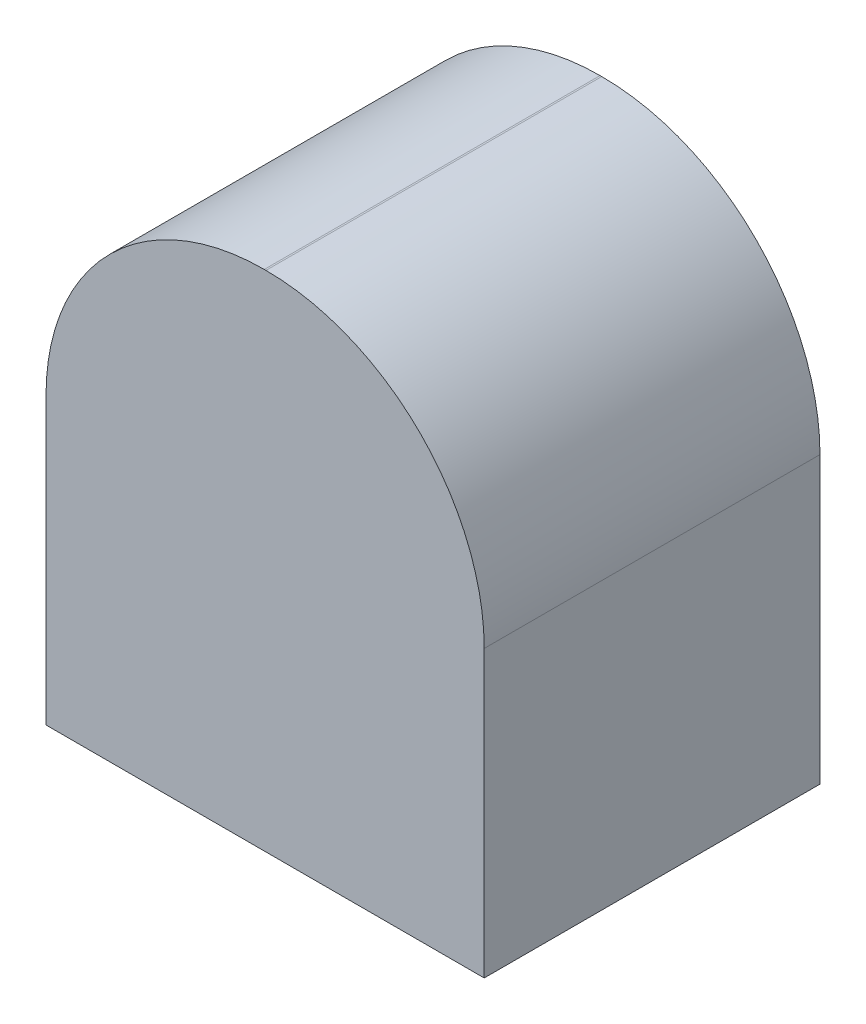
ISO-10303-21;
HEADER;
FILE_DESCRIPTION(('STEP AP214'),'2;1');
FILE_NAME('part.step','',(''),(''),'','','');
FILE_SCHEMA(('AUTOMOTIVE_DESIGN { 1 0 10303 214 1 1 1 1 }'));
ENDSEC;
DATA;
#1=APPLICATION_CONTEXT('core data for automotive mechanical design processes');
#2=APPLICATION_PROTOCOL_DEFINITION('international standard','automotive_design',2000,#1);
#3=PRODUCT_CONTEXT('',#1,'mechanical');
#4=PRODUCT('Part','Part','',(#3));
#5=PRODUCT_RELATED_PRODUCT_CATEGORY('part','',(#4));
#6=PRODUCT_DEFINITION_FORMATION('','',#4);
#7=PRODUCT_DEFINITION_CONTEXT('part definition',#1,'design');
#8=PRODUCT_DEFINITION('design','',#6,#7);
#9=PRODUCT_DEFINITION_SHAPE('','',#8);
#10=(LENGTH_UNIT() NAMED_UNIT(*) SI_UNIT(.MILLI.,.METRE.));
#11=(NAMED_UNIT(*) PLANE_ANGLE_UNIT() SI_UNIT($,.RADIAN.));
#12=(NAMED_UNIT(*) SI_UNIT($,.STERADIAN.) SOLID_ANGLE_UNIT());
#13=UNCERTAINTY_MEASURE_WITH_UNIT(LENGTH_MEASURE(1.E-05),#10,'distance_accuracy_value','');
#14=(GEOMETRIC_REPRESENTATION_CONTEXT(3) GLOBAL_UNCERTAINTY_ASSIGNED_CONTEXT((#13)) GLOBAL_UNIT_ASSIGNED_CONTEXT((#10,
#11,#12)) REPRESENTATION_CONTEXT('',''));
#15=CARTESIAN_POINT('',(0.,0.,0.));
#16=DIRECTION('',(0.,0.,1.));
#17=DIRECTION('',(1.,0.,0.));
#18=AXIS2_PLACEMENT_3D('',#15,#16,#17);
#19=CARTESIAN_POINT('',(0.86950042,0.,0.1999996));
#20=DIRECTION('',(0.,0.,-1.));
#21=DIRECTION('',(-1.,0.,0.));
#22=AXIS2_PLACEMENT_3D('',#19,#20,#21);
#23=PLANE('',#22);
#24=DIRECTION('',(1.,0.,0.));
#25=VECTOR('',#24,1.);
#26=CARTESIAN_POINT('',(1.13050066,0.2999994,0.1999996));
#27=LINE('',#26,#25);
#28=CARTESIAN_POINT('',(0.99950042,0.2999994,0.1999996));
#29=VERTEX_POINT('',#28);
#30=CARTESIAN_POINT('',(1.00050066,0.2999994,0.1999996));
#31=VERTEX_POINT('',#30);
#32=EDGE_CURVE('E11',#29,#31,#27,.T.);
#33=ORIENTED_EDGE('',*,*,#32,.F.);
#34=CARTESIAN_POINT('',(0.99950042,0.1699994,0.1999996));
#35=DIRECTION('',(0.,0.,-1.));
#36=DIRECTION('',(1.,0.,0.));
#37=AXIS2_PLACEMENT_3D('',#34,#35,#36);
#38=CIRCLE('',#37,0.13);
#39=CARTESIAN_POINT('',(0.86950042,0.1699994,0.1999996));
#40=VERTEX_POINT('',#39);
#41=EDGE_CURVE('E24',#40,#29,#38,.T.);
#42=ORIENTED_EDGE('',*,*,#41,.F.);
#43=DIRECTION('',(0.,1.,0.));
#44=VECTOR('',#43,1.);
#45=CARTESIAN_POINT('',(0.86950042,0.,0.1999996));
#46=LINE('',#45,#44);
#47=CARTESIAN_POINT('',(0.86950042,0.,0.1999996));
#48=VERTEX_POINT('',#47);
#49=EDGE_CURVE('E117',#48,#40,#46,.T.);
#50=ORIENTED_EDGE('',*,*,#49,.F.);
#51=DIRECTION('',(-1.,0.,0.));
#52=VECTOR('',#51,1.);
#53=CARTESIAN_POINT('',(0.86950042,0.,0.1999996));
#54=LINE('',#53,#52);
#55=CARTESIAN_POINT('',(1.13050066,0.,0.1999996));
#56=VERTEX_POINT('',#55);
#57=EDGE_CURVE('E115',#56,#48,#54,.T.);
#58=ORIENTED_EDGE('',*,*,#57,.F.);
#59=DIRECTION('',(0.,-1.,0.));
#60=VECTOR('',#59,1.);
#61=CARTESIAN_POINT('',(1.13050066,0.,0.1999996));
#62=LINE('',#61,#60);
#63=CARTESIAN_POINT('',(1.13050066,0.1699994,0.1999996));
#64=VERTEX_POINT('',#63);
#65=EDGE_CURVE('E73',#64,#56,#62,.T.);
#66=ORIENTED_EDGE('',*,*,#65,.F.);
#67=CARTESIAN_POINT('',(1.00050066,0.1699994,0.1999996));
#68=DIRECTION('',(0.,0.,-1.));
#69=DIRECTION('',(1.,0.,0.));
#70=AXIS2_PLACEMENT_3D('',#67,#68,#69);
#71=CIRCLE('',#70,0.13);
#72=EDGE_CURVE('E111',#31,#64,#71,.T.);
#73=ORIENTED_EDGE('',*,*,#72,.F.);
#74=EDGE_LOOP('',(#33,#42,#50,#58,#66,#73));
#75=FACE_BOUND('',#74,.T.);
#76=ADVANCED_FACE('F17',(#75),#23,.F.);
#77=CARTESIAN_POINT('',(1.00050066,0.1699994,0.));
#78=DIRECTION('',(0.,0.,1.));
#79=DIRECTION('',(1.,0.,0.));
#80=AXIS2_PLACEMENT_3D('',#77,#78,#79);
#81=CYLINDRICAL_SURFACE('',#80,0.13);
#82=ORIENTED_EDGE('',*,*,#72,.T.);
#83=DIRECTION('',(0.,0.,-1.));
#84=VECTOR('',#83,1.);
#85=CARTESIAN_POINT('',(1.13050066,0.1699994,0.));
#86=LINE('',#85,#84);
#87=CARTESIAN_POINT('',(1.13050066,0.1699994,0.));
#88=VERTEX_POINT('',#87);
#89=EDGE_CURVE('E109',#64,#88,#86,.T.);
#90=ORIENTED_EDGE('',*,*,#89,.T.);
#91=CARTESIAN_POINT('',(1.00050066,0.1699994,0.));
#92=DIRECTION('',(0.,0.,1.));
#93=DIRECTION('',(1.,0.,0.));
#94=AXIS2_PLACEMENT_3D('',#91,#92,#93);
#95=CIRCLE('',#94,0.13);
#96=CARTESIAN_POINT('',(1.00050066,0.2999994,0.));
#97=VERTEX_POINT('',#96);
#98=EDGE_CURVE('E89',#88,#97,#95,.T.);
#99=ORIENTED_EDGE('',*,*,#98,.T.);
#100=DIRECTION('',(0.,0.,1.));
#101=VECTOR('',#100,1.);
#102=CARTESIAN_POINT('',(1.00050066,0.2999994,0.));
#103=LINE('',#102,#101);
#104=EDGE_CURVE('E105',#97,#31,#103,.T.);
#105=ORIENTED_EDGE('',*,*,#104,.T.);
#106=EDGE_LOOP('',(#82,#90,#99,#105));
#107=FACE_BOUND('',#106,.T.);
#108=ADVANCED_FACE('F127',(#107),#81,.T.);
#109=CARTESIAN_POINT('',(1.13050066,0.2999994,0.));
#110=DIRECTION('',(0.,-1.,0.));
#111=DIRECTION('',(0.,0.,-1.));
#112=AXIS2_PLACEMENT_3D('',#109,#110,#111);
#113=PLANE('',#112);
#114=DIRECTION('',(1.,0.,0.));
#115=VECTOR('',#114,1.);
#116=CARTESIAN_POINT('',(0.86950042,0.2999994,0.));
#117=LINE('',#116,#115);
#118=CARTESIAN_POINT('',(0.99950042,0.2999994,0.));
#119=VERTEX_POINT('',#118);
#120=EDGE_CURVE('E103',#119,#97,#117,.T.);
#121=ORIENTED_EDGE('',*,*,#120,.F.);
#122=DIRECTION('',(0.,0.,-1.));
#123=VECTOR('',#122,1.);
#124=CARTESIAN_POINT('',(0.99950042,0.2999994,0.));
#125=LINE('',#124,#123);
#126=EDGE_CURVE('E100',#29,#119,#125,.T.);
#127=ORIENTED_EDGE('',*,*,#126,.F.);
#128=ORIENTED_EDGE('',*,*,#32,.T.);
#129=ORIENTED_EDGE('',*,*,#104,.F.);
#130=EDGE_LOOP('',(#121,#127,#128,#129));
#131=FACE_BOUND('',#130,.T.);
#132=ADVANCED_FACE('F123',(#131),#113,.F.);
#133=CARTESIAN_POINT('',(0.99950042,0.1699994,0.));
#134=DIRECTION('',(0.,0.,1.));
#135=DIRECTION('',(1.,0.,0.));
#136=AXIS2_PLACEMENT_3D('',#133,#134,#135);
#137=CYLINDRICAL_SURFACE('',#136,0.13);
#138=ORIENTED_EDGE('',*,*,#41,.T.);
#139=ORIENTED_EDGE('',*,*,#126,.T.);
#140=CARTESIAN_POINT('',(0.99950042,0.1699994,0.));
#141=DIRECTION('',(0.,0.,1.));
#142=DIRECTION('',(1.,0.,0.));
#143=AXIS2_PLACEMENT_3D('',#140,#141,#142);
#144=CIRCLE('',#143,0.13);
#145=CARTESIAN_POINT('',(0.86950042,0.1699994,0.));
#146=VERTEX_POINT('',#145);
#147=EDGE_CURVE('E98',#119,#146,#144,.T.);
#148=ORIENTED_EDGE('',*,*,#147,.T.);
#149=DIRECTION('',(0.,0.,1.));
#150=VECTOR('',#149,1.);
#151=CARTESIAN_POINT('',(0.86950042,0.1699994,0.));
#152=LINE('',#151,#150);
#153=EDGE_CURVE('E95',#146,#40,#152,.T.);
#154=ORIENTED_EDGE('',*,*,#153,.T.);
#155=EDGE_LOOP('',(#138,#139,#148,#154));
#156=FACE_BOUND('',#155,.T.);
#157=ADVANCED_FACE('F120',(#156),#137,.T.);
#158=CARTESIAN_POINT('',(0.86950042,0.2999994,0.));
#159=DIRECTION('',(1.,0.,0.));
#160=DIRECTION('',(0.,0.,-1.));
#161=AXIS2_PLACEMENT_3D('',#158,#159,#160);
#162=PLANE('',#161);
#163=DIRECTION('',(0.,1.,0.));
#164=VECTOR('',#163,1.);
#165=CARTESIAN_POINT('',(0.86950042,0.2999994,0.));
#166=LINE('',#165,#164);
#167=CARTESIAN_POINT('',(0.86950042,0.,0.));
#168=VERTEX_POINT('',#167);
#169=EDGE_CURVE('E93',#168,#146,#166,.T.);
#170=ORIENTED_EDGE('',*,*,#169,.F.);
#171=DIRECTION('',(0.,0.,-1.));
#172=VECTOR('',#171,1.);
#173=CARTESIAN_POINT('',(0.86950042,0.,0.));
#174=LINE('',#173,#172);
#175=EDGE_CURVE('E76',#48,#168,#174,.T.);
#176=ORIENTED_EDGE('',*,*,#175,.F.);
#177=ORIENTED_EDGE('',*,*,#49,.T.);
#178=ORIENTED_EDGE('',*,*,#153,.F.);
#179=EDGE_LOOP('',(#170,#176,#177,#178));
#180=FACE_BOUND('',#179,.T.);
#181=ADVANCED_FACE('F125',(#180),#162,.F.);
#182=CARTESIAN_POINT('',(0.86950042,0.,0.));
#183=DIRECTION('',(0.,1.,0.));
#184=DIRECTION('',(0.,0.,1.));
#185=AXIS2_PLACEMENT_3D('',#182,#183,#184);
#186=PLANE('',#185);
#187=DIRECTION('',(0.,0.,-1.));
#188=VECTOR('',#187,1.);
#189=CARTESIAN_POINT('',(1.13050066,0.,0.));
#190=LINE('',#189,#188);
#191=CARTESIAN_POINT('',(1.13050066,0.,0.));
#192=VERTEX_POINT('',#191);
#193=EDGE_CURVE('E67',#56,#192,#190,.T.);
#194=ORIENTED_EDGE('',*,*,#193,.F.);
#195=ORIENTED_EDGE('',*,*,#57,.T.);
#196=ORIENTED_EDGE('',*,*,#175,.T.);
#197=DIRECTION('',(-1.,0.,0.));
#198=VECTOR('',#197,1.);
#199=CARTESIAN_POINT('',(0.86950042,0.,0.));
#200=LINE('',#199,#198);
#201=EDGE_CURVE('E77',#192,#168,#200,.T.);
#202=ORIENTED_EDGE('',*,*,#201,.F.);
#203=EDGE_LOOP('',(#194,#195,#196,#202));
#204=FACE_BOUND('',#203,.T.);
#205=ADVANCED_FACE('F81',(#204),#186,.F.);
#206=CARTESIAN_POINT('',(1.13050066,0.,0.));
#207=DIRECTION('',(-1.,0.,0.));
#208=DIRECTION('',(0.,0.,1.));
#209=AXIS2_PLACEMENT_3D('',#206,#207,#208);
#210=PLANE('',#209);
#211=DIRECTION('',(0.,-1.,0.));
#212=VECTOR('',#211,1.);
#213=CARTESIAN_POINT('',(1.13050066,0.,0.));
#214=LINE('',#213,#212);
#215=EDGE_CURVE('E72',#88,#192,#214,.T.);
#216=ORIENTED_EDGE('',*,*,#215,.F.);
#217=ORIENTED_EDGE('',*,*,#89,.F.);
#218=ORIENTED_EDGE('',*,*,#65,.T.);
#219=ORIENTED_EDGE('',*,*,#193,.T.);
#220=EDGE_LOOP('',(#216,#217,#218,#219));
#221=FACE_BOUND('',#220,.T.);
#222=ADVANCED_FACE('F69',(#221),#210,.F.);
#223=CARTESIAN_POINT('',(0.86950042,0.,0.));
#224=DIRECTION('',(0.,0.,-1.));
#225=DIRECTION('',(-1.,0.,0.));
#226=AXIS2_PLACEMENT_3D('',#223,#224,#225);
#227=PLANE('',#226);
#228=ORIENTED_EDGE('',*,*,#120,.T.);
#229=ORIENTED_EDGE('',*,*,#98,.F.);
#230=ORIENTED_EDGE('',*,*,#215,.T.);
#231=ORIENTED_EDGE('',*,*,#201,.T.);
#232=ORIENTED_EDGE('',*,*,#169,.T.);
#233=ORIENTED_EDGE('',*,*,#147,.F.);
#234=EDGE_LOOP('',(#228,#229,#230,#231,#232,#233));
#235=FACE_BOUND('',#234,.T.);
#236=ADVANCED_FACE('F88',(#235),#227,.T.);
#237=CLOSED_SHELL('',(#76,#108,#132,#157,#181,#205,#222,#236));
#238=MANIFOLD_SOLID_BREP('B1',#237);
#239=ADVANCED_BREP_SHAPE_REPRESENTATION('',(#18,#238),#14);
#240=SHAPE_DEFINITION_REPRESENTATION(#9,#239);
ENDSEC;
END-ISO-10303-21;
